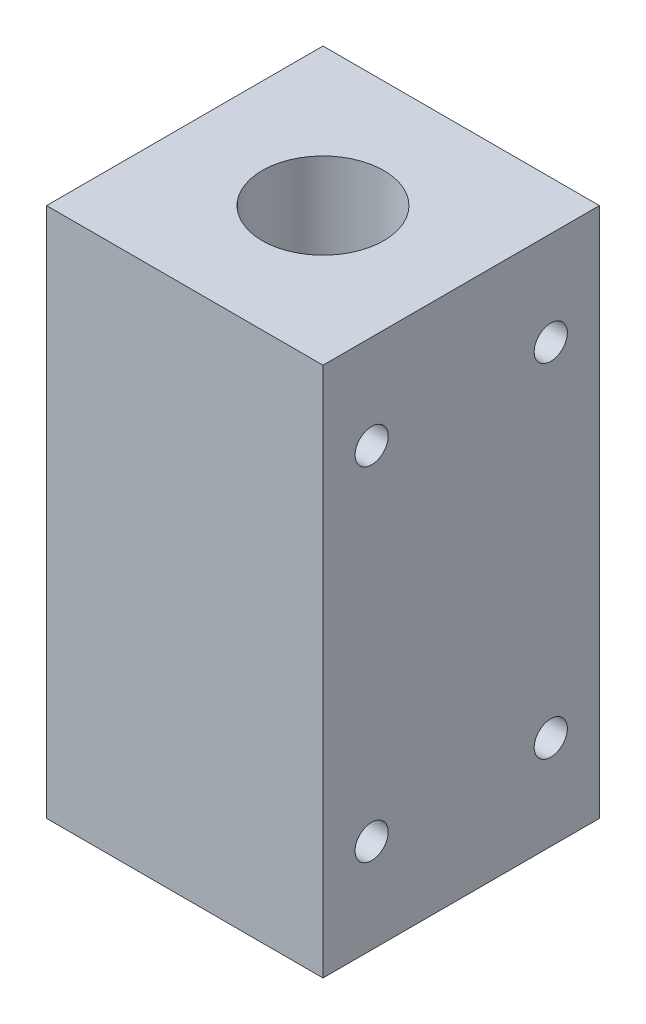
ISO-10303-21;
HEADER;
FILE_DESCRIPTION(('STEP AP214'),'2;1');
FILE_NAME('part.step','',(''),(''),'','','');
FILE_SCHEMA(('AUTOMOTIVE_DESIGN { 1 0 10303 214 1 1 1 1 }'));
ENDSEC;
DATA;
#1=APPLICATION_CONTEXT('core data for automotive mechanical design processes');
#2=APPLICATION_PROTOCOL_DEFINITION('international standard','automotive_design',2000,#1);
#3=PRODUCT_CONTEXT('',#1,'mechanical');
#4=PRODUCT('Part','Part','',(#3));
#5=PRODUCT_RELATED_PRODUCT_CATEGORY('part','',(#4));
#6=PRODUCT_DEFINITION_FORMATION('','',#4);
#7=PRODUCT_DEFINITION_CONTEXT('part definition',#1,'design');
#8=PRODUCT_DEFINITION('design','',#6,#7);
#9=PRODUCT_DEFINITION_SHAPE('','',#8);
#10=(LENGTH_UNIT() NAMED_UNIT(*) SI_UNIT(.MILLI.,.METRE.));
#11=(NAMED_UNIT(*) PLANE_ANGLE_UNIT() SI_UNIT($,.RADIAN.));
#12=(NAMED_UNIT(*) SI_UNIT($,.STERADIAN.) SOLID_ANGLE_UNIT());
#13=UNCERTAINTY_MEASURE_WITH_UNIT(LENGTH_MEASURE(1.E-05),#10,'distance_accuracy_value','');
#14=(GEOMETRIC_REPRESENTATION_CONTEXT(3) GLOBAL_UNCERTAINTY_ASSIGNED_CONTEXT((#13)) GLOBAL_UNIT_ASSIGNED_CONTEXT((#10,
#11,#12)) REPRESENTATION_CONTEXT('',''));
#15=CARTESIAN_POINT('',(0.,0.,0.));
#16=DIRECTION('',(0.,0.,1.));
#17=DIRECTION('',(1.,0.,0.));
#18=AXIS2_PLACEMENT_3D('',#15,#16,#17);
#19=CARTESIAN_POINT('',(0.,48.,0.));
#20=DIRECTION('',(0.,-1.,0.));
#21=DIRECTION('',(0.,0.,-1.));
#22=AXIS2_PLACEMENT_3D('',#19,#20,#21);
#23=PLANE('',#22);
#24=DIRECTION('',(0.,0.,1.));
#25=VECTOR('',#24,1.);
#26=CARTESIAN_POINT('',(-12.5,48.,-12.5));
#27=LINE('',#26,#25);
#28=CARTESIAN_POINT('',(-12.5,48.,-12.5));
#29=VERTEX_POINT('',#28);
#30=CARTESIAN_POINT('',(-12.5,48.,12.5));
#31=VERTEX_POINT('',#30);
#32=EDGE_CURVE('E92',#29,#31,#27,.T.);
#33=ORIENTED_EDGE('',*,*,#32,.T.);
#34=DIRECTION('',(1.,0.,0.));
#35=VECTOR('',#34,1.);
#36=CARTESIAN_POINT('',(12.5,48.,12.5));
#37=LINE('',#36,#35);
#38=CARTESIAN_POINT('',(12.5,48.,12.5));
#39=VERTEX_POINT('',#38);
#40=EDGE_CURVE('E87',#31,#39,#37,.T.);
#41=ORIENTED_EDGE('',*,*,#40,.T.);
#42=DIRECTION('',(0.,0.,-1.));
#43=VECTOR('',#42,1.);
#44=CARTESIAN_POINT('',(12.5,48.,-12.5));
#45=LINE('',#44,#43);
#46=CARTESIAN_POINT('',(12.5,48.,-12.5));
#47=VERTEX_POINT('',#46);
#48=EDGE_CURVE('E90',#39,#47,#45,.T.);
#49=ORIENTED_EDGE('',*,*,#48,.T.);
#50=DIRECTION('',(-1.,0.,0.));
#51=VECTOR('',#50,1.);
#52=CARTESIAN_POINT('',(12.5,48.,-12.5));
#53=LINE('',#52,#51);
#54=EDGE_CURVE('E57',#47,#29,#53,.T.);
#55=ORIENTED_EDGE('',*,*,#54,.T.);
#56=EDGE_LOOP('',(#33,#41,#49,#55));
#57=FACE_BOUND('',#56,.T.);
#58=CARTESIAN_POINT('',(0.,48.,0.));
#59=DIRECTION('',(0.,1.,0.));
#60=DIRECTION('',(0.,0.,1.));
#61=AXIS2_PLACEMENT_3D('',#58,#59,#60);
#62=CIRCLE('',#61,5.5);
#63=CARTESIAN_POINT('',(0.,48.,5.5));
#64=VERTEX_POINT('',#63);
#65=EDGE_CURVE('E112',#64,#64,#62,.T.);
#66=ORIENTED_EDGE('',*,*,#65,.F.);
#67=EDGE_LOOP('',(#66));
#68=FACE_BOUND('',#67,.T.);
#69=ADVANCED_FACE('F39',(#57,#68),#23,.F.);
#70=CARTESIAN_POINT('',(0.,0.,0.));
#71=DIRECTION('',(0.,-1.,0.));
#72=DIRECTION('',(0.,0.,-1.));
#73=AXIS2_PLACEMENT_3D('',#70,#71,#72);
#74=PLANE('',#73);
#75=DIRECTION('',(0.,0.,1.));
#76=VECTOR('',#75,1.);
#77=CARTESIAN_POINT('',(-12.5,0.,-12.5));
#78=LINE('',#77,#76);
#79=CARTESIAN_POINT('',(-12.5,0.,-12.5));
#80=VERTEX_POINT('',#79);
#81=CARTESIAN_POINT('',(-12.5,0.,12.5));
#82=VERTEX_POINT('',#81);
#83=EDGE_CURVE('E108',#80,#82,#78,.T.);
#84=ORIENTED_EDGE('',*,*,#83,.F.);
#85=DIRECTION('',(-1.,0.,0.));
#86=VECTOR('',#85,1.);
#87=CARTESIAN_POINT('',(12.5,0.,-12.5));
#88=LINE('',#87,#86);
#89=CARTESIAN_POINT('',(12.5,0.,-12.5));
#90=VERTEX_POINT('',#89);
#91=EDGE_CURVE('E80',#90,#80,#88,.T.);
#92=ORIENTED_EDGE('',*,*,#91,.F.);
#93=DIRECTION('',(0.,0.,-1.));
#94=VECTOR('',#93,1.);
#95=CARTESIAN_POINT('',(12.5,0.,-12.5));
#96=LINE('',#95,#94);
#97=CARTESIAN_POINT('',(12.5,0.,12.5));
#98=VERTEX_POINT('',#97);
#99=EDGE_CURVE('E74',#98,#90,#96,.T.);
#100=ORIENTED_EDGE('',*,*,#99,.F.);
#101=DIRECTION('',(1.,0.,0.));
#102=VECTOR('',#101,1.);
#103=CARTESIAN_POINT('',(12.5,0.,12.5));
#104=LINE('',#103,#102);
#105=EDGE_CURVE('E97',#82,#98,#104,.T.);
#106=ORIENTED_EDGE('',*,*,#105,.F.);
#107=EDGE_LOOP('',(#84,#92,#100,#106));
#108=FACE_BOUND('',#107,.T.);
#109=CARTESIAN_POINT('',(0.,0.,0.));
#110=DIRECTION('',(0.,1.,0.));
#111=DIRECTION('',(0.,0.,1.));
#112=AXIS2_PLACEMENT_3D('',#109,#110,#111);
#113=CIRCLE('',#112,5.5);
#114=CARTESIAN_POINT('',(0.,0.,5.5));
#115=VERTEX_POINT('',#114);
#116=EDGE_CURVE('E130',#115,#115,#113,.T.);
#117=ORIENTED_EDGE('',*,*,#116,.T.);
#118=EDGE_LOOP('',(#117));
#119=FACE_BOUND('',#118,.T.);
#120=ADVANCED_FACE('F125',(#108,#119),#74,.T.);
#121=CARTESIAN_POINT('',(-12.5,48.,-12.5));
#122=DIRECTION('',(1.,0.,0.));
#123=DIRECTION('',(0.,0.,-1.));
#124=AXIS2_PLACEMENT_3D('',#121,#122,#123);
#125=PLANE('',#124);
#126=ORIENTED_EDGE('',*,*,#83,.T.);
#127=DIRECTION('',(0.,-1.,0.));
#128=VECTOR('',#127,1.);
#129=CARTESIAN_POINT('',(-12.5,48.,12.5));
#130=LINE('',#129,#128);
#131=EDGE_CURVE('E11',#31,#82,#130,.T.);
#132=ORIENTED_EDGE('',*,*,#131,.F.);
#133=ORIENTED_EDGE('',*,*,#32,.F.);
#134=DIRECTION('',(0.,-1.,0.));
#135=VECTOR('',#134,1.);
#136=CARTESIAN_POINT('',(-12.5,48.,-12.5));
#137=LINE('',#136,#135);
#138=EDGE_CURVE('E104',#29,#80,#137,.T.);
#139=ORIENTED_EDGE('',*,*,#138,.T.);
#140=EDGE_LOOP('',(#126,#132,#133,#139));
#141=FACE_BOUND('',#140,.T.);
#142=ADVANCED_FACE('F41',(#141),#125,.F.);
#143=CARTESIAN_POINT('',(12.5,48.,12.5));
#144=DIRECTION('',(0.,0.,-1.));
#145=DIRECTION('',(-1.,0.,0.));
#146=AXIS2_PLACEMENT_3D('',#143,#144,#145);
#147=PLANE('',#146);
#148=ORIENTED_EDGE('',*,*,#105,.T.);
#149=DIRECTION('',(0.,-1.,0.));
#150=VECTOR('',#149,1.);
#151=CARTESIAN_POINT('',(12.5,48.,12.5));
#152=LINE('',#151,#150);
#153=EDGE_CURVE('E49',#39,#98,#152,.T.);
#154=ORIENTED_EDGE('',*,*,#153,.F.);
#155=ORIENTED_EDGE('',*,*,#40,.F.);
#156=ORIENTED_EDGE('',*,*,#131,.T.);
#157=EDGE_LOOP('',(#148,#154,#155,#156));
#158=FACE_BOUND('',#157,.T.);
#159=ADVANCED_FACE('F96',(#158),#147,.F.);
#160=CARTESIAN_POINT('',(12.5,48.,-12.5));
#161=DIRECTION('',(-1.,0.,0.));
#162=DIRECTION('',(0.,0.,1.));
#163=AXIS2_PLACEMENT_3D('',#160,#161,#162);
#164=PLANE('',#163);
#165=CARTESIAN_POINT('',(12.5,39.5,-8.1));
#166=DIRECTION('',(1.,0.,0.));
#167=DIRECTION('',(0.,0.,1.));
#168=AXIS2_PLACEMENT_3D('',#165,#166,#167);
#169=CIRCLE('',#168,1.5);
#170=CARTESIAN_POINT('',(12.5,39.5,-6.6));
#171=VERTEX_POINT('',#170);
#172=EDGE_CURVE('E146',#171,#171,#169,.T.);
#173=ORIENTED_EDGE('',*,*,#172,.F.);
#174=EDGE_LOOP('',(#173));
#175=FACE_BOUND('',#174,.T.);
#176=CARTESIAN_POINT('',(12.5,39.5,8.1));
#177=DIRECTION('',(1.,0.,0.));
#178=DIRECTION('',(0.,0.,-1.));
#179=AXIS2_PLACEMENT_3D('',#176,#177,#178);
#180=CIRCLE('',#179,1.5);
#181=CARTESIAN_POINT('',(12.5,39.5,6.6));
#182=VERTEX_POINT('',#181);
#183=EDGE_CURVE('E154',#182,#182,#180,.T.);
#184=ORIENTED_EDGE('',*,*,#183,.F.);
#185=EDGE_LOOP('',(#184));
#186=FACE_BOUND('',#185,.T.);
#187=CARTESIAN_POINT('',(12.5,8.5,8.1));
#188=DIRECTION('',(1.,0.,0.));
#189=DIRECTION('',(0.,0.,1.));
#190=AXIS2_PLACEMENT_3D('',#187,#188,#189);
#191=CIRCLE('',#190,1.5);
#192=CARTESIAN_POINT('',(12.5,8.5,9.6));
#193=VERTEX_POINT('',#192);
#194=EDGE_CURVE('E162',#193,#193,#191,.T.);
#195=ORIENTED_EDGE('',*,*,#194,.F.);
#196=EDGE_LOOP('',(#195));
#197=FACE_BOUND('',#196,.T.);
#198=CARTESIAN_POINT('',(12.5,8.5,-8.1));
#199=DIRECTION('',(1.,0.,0.));
#200=DIRECTION('',(0.,0.,-1.));
#201=AXIS2_PLACEMENT_3D('',#198,#199,#200);
#202=CIRCLE('',#201,1.5);
#203=CARTESIAN_POINT('',(12.5,8.5,-9.6));
#204=VERTEX_POINT('',#203);
#205=EDGE_CURVE('E138',#204,#204,#202,.T.);
#206=ORIENTED_EDGE('',*,*,#205,.F.);
#207=EDGE_LOOP('',(#206));
#208=FACE_BOUND('',#207,.T.);
#209=ORIENTED_EDGE('',*,*,#99,.T.);
#210=DIRECTION('',(0.,-1.,0.));
#211=VECTOR('',#210,1.);
#212=CARTESIAN_POINT('',(12.5,48.,-12.5));
#213=LINE('',#212,#211);
#214=EDGE_CURVE('E99',#47,#90,#213,.T.);
#215=ORIENTED_EDGE('',*,*,#214,.F.);
#216=ORIENTED_EDGE('',*,*,#48,.F.);
#217=ORIENTED_EDGE('',*,*,#153,.T.);
#218=EDGE_LOOP('',(#209,#215,#216,#217));
#219=FACE_BOUND('',#218,.T.);
#220=ADVANCED_FACE('F100',(#175,#186,#197,#208,#219),#164,.F.);
#221=CARTESIAN_POINT('',(12.5,48.,-12.5));
#222=DIRECTION('',(0.,0.,1.));
#223=DIRECTION('',(1.,0.,0.));
#224=AXIS2_PLACEMENT_3D('',#221,#222,#223);
#225=PLANE('',#224);
#226=ORIENTED_EDGE('',*,*,#91,.T.);
#227=ORIENTED_EDGE('',*,*,#138,.F.);
#228=ORIENTED_EDGE('',*,*,#54,.F.);
#229=ORIENTED_EDGE('',*,*,#214,.T.);
#230=EDGE_LOOP('',(#226,#227,#228,#229));
#231=FACE_BOUND('',#230,.T.);
#232=ADVANCED_FACE('F122',(#231),#225,.F.);
#233=CARTESIAN_POINT('',(0.,48.,0.));
#234=DIRECTION('',(0.,-1.,0.));
#235=DIRECTION('',(0.,0.,-1.));
#236=AXIS2_PLACEMENT_3D('',#233,#234,#235);
#237=CYLINDRICAL_SURFACE('',#236,5.5);
#238=ORIENTED_EDGE('',*,*,#65,.T.);
#239=EDGE_LOOP('',(#238));
#240=FACE_BOUND('',#239,.T.);
#241=ORIENTED_EDGE('',*,*,#116,.F.);
#242=EDGE_LOOP('',(#241));
#243=FACE_BOUND('',#242,.T.);
#244=ADVANCED_FACE('F187',(#240,#243),#237,.F.);
#245=CARTESIAN_POINT('',(7.5,8.5,-8.1));
#246=DIRECTION('',(1.,0.,0.));
#247=DIRECTION('',(0.,0.,-1.));
#248=AXIS2_PLACEMENT_3D('',#245,#246,#247);
#249=CYLINDRICAL_SURFACE('',#248,1.5);
#250=CARTESIAN_POINT('',(7.5,8.5,-8.1));
#251=DIRECTION('',(1.,0.,0.));
#252=DIRECTION('',(0.,0.,-1.));
#253=AXIS2_PLACEMENT_3D('',#250,#251,#252);
#254=CIRCLE('',#253,1.5);
#255=CARTESIAN_POINT('',(7.5,8.5,-9.6));
#256=VERTEX_POINT('',#255);
#257=EDGE_CURVE('E134',#256,#256,#254,.T.);
#258=ORIENTED_EDGE('',*,*,#257,.F.);
#259=EDGE_LOOP('',(#258));
#260=FACE_BOUND('',#259,.T.);
#261=ORIENTED_EDGE('',*,*,#205,.T.);
#262=EDGE_LOOP('',(#261));
#263=FACE_BOUND('',#262,.T.);
#264=ADVANCED_FACE('F185',(#260,#263),#249,.F.);
#265=CARTESIAN_POINT('',(7.5,8.5,-8.1));
#266=DIRECTION('',(1.,0.,0.));
#267=DIRECTION('',(0.,0.,-1.));
#268=AXIS2_PLACEMENT_3D('',#265,#266,#267);
#269=PLANE('',#268);
#270=ORIENTED_EDGE('',*,*,#257,.T.);
#271=EDGE_LOOP('',(#270));
#272=FACE_BOUND('',#271,.T.);
#273=ADVANCED_FACE('F175',(#272),#269,.T.);
#274=CARTESIAN_POINT('',(7.5,8.5,8.1));
#275=DIRECTION('',(1.,0.,0.));
#276=DIRECTION('',(0.,0.,-1.));
#277=AXIS2_PLACEMENT_3D('',#274,#275,#276);
#278=CYLINDRICAL_SURFACE('',#277,1.5);
#279=CARTESIAN_POINT('',(7.5,8.5,8.1));
#280=DIRECTION('',(1.,0.,0.));
#281=DIRECTION('',(0.,0.,1.));
#282=AXIS2_PLACEMENT_3D('',#279,#280,#281);
#283=CIRCLE('',#282,1.5);
#284=CARTESIAN_POINT('',(7.5,8.5,9.6));
#285=VERTEX_POINT('',#284);
#286=EDGE_CURVE('E142',#285,#285,#283,.T.);
#287=ORIENTED_EDGE('',*,*,#286,.F.);
#288=EDGE_LOOP('',(#287));
#289=FACE_BOUND('',#288,.T.);
#290=ORIENTED_EDGE('',*,*,#194,.T.);
#291=EDGE_LOOP('',(#290));
#292=FACE_BOUND('',#291,.T.);
#293=ADVANCED_FACE('F172',(#289,#292),#278,.F.);
#294=CARTESIAN_POINT('',(7.5,8.5,8.1));
#295=DIRECTION('',(-1.,0.,0.));
#296=DIRECTION('',(0.,0.,1.));
#297=AXIS2_PLACEMENT_3D('',#294,#295,#296);
#298=PLANE('',#297);
#299=ORIENTED_EDGE('',*,*,#286,.T.);
#300=EDGE_LOOP('',(#299));
#301=FACE_BOUND('',#300,.T.);
#302=ADVANCED_FACE('F170',(#301),#298,.F.);
#303=CARTESIAN_POINT('',(7.5,39.5,8.1));
#304=DIRECTION('',(1.,0.,0.));
#305=DIRECTION('',(0.,0.,-1.));
#306=AXIS2_PLACEMENT_3D('',#303,#304,#305);
#307=CYLINDRICAL_SURFACE('',#306,1.5);
#308=CARTESIAN_POINT('',(7.5,39.5,8.1));
#309=DIRECTION('',(1.,0.,0.));
#310=DIRECTION('',(0.,0.,-1.));
#311=AXIS2_PLACEMENT_3D('',#308,#309,#310);
#312=CIRCLE('',#311,1.5);
#313=CARTESIAN_POINT('',(7.5,39.5,6.6));
#314=VERTEX_POINT('',#313);
#315=EDGE_CURVE('E158',#314,#314,#312,.T.);
#316=ORIENTED_EDGE('',*,*,#315,.F.);
#317=EDGE_LOOP('',(#316));
#318=FACE_BOUND('',#317,.T.);
#319=ORIENTED_EDGE('',*,*,#183,.T.);
#320=EDGE_LOOP('',(#319));
#321=FACE_BOUND('',#320,.T.);
#322=ADVANCED_FACE('F266',(#318,#321),#307,.F.);
#323=CARTESIAN_POINT('',(7.5,39.5,8.1));
#324=DIRECTION('',(1.,0.,0.));
#325=DIRECTION('',(0.,0.,-1.));
#326=AXIS2_PLACEMENT_3D('',#323,#324,#325);
#327=PLANE('',#326);
#328=ORIENTED_EDGE('',*,*,#315,.T.);
#329=EDGE_LOOP('',(#328));
#330=FACE_BOUND('',#329,.T.);
#331=ADVANCED_FACE('F274',(#330),#327,.T.);
#332=CARTESIAN_POINT('',(7.5,39.5,-8.1));
#333=DIRECTION('',(1.,0.,0.));
#334=DIRECTION('',(0.,0.,-1.));
#335=AXIS2_PLACEMENT_3D('',#332,#333,#334);
#336=CYLINDRICAL_SURFACE('',#335,1.5);
#337=CARTESIAN_POINT('',(7.5,39.5,-8.1));
#338=DIRECTION('',(1.,0.,0.));
#339=DIRECTION('',(0.,0.,1.));
#340=AXIS2_PLACEMENT_3D('',#337,#338,#339);
#341=CIRCLE('',#340,1.5);
#342=CARTESIAN_POINT('',(7.5,39.5,-6.6));
#343=VERTEX_POINT('',#342);
#344=EDGE_CURVE('E150',#343,#343,#341,.T.);
#345=ORIENTED_EDGE('',*,*,#344,.F.);
#346=EDGE_LOOP('',(#345));
#347=FACE_BOUND('',#346,.T.);
#348=ORIENTED_EDGE('',*,*,#172,.T.);
#349=EDGE_LOOP('',(#348));
#350=FACE_BOUND('',#349,.T.);
#351=ADVANCED_FACE('F283',(#347,#350),#336,.F.);
#352=CARTESIAN_POINT('',(7.5,39.5,-8.1));
#353=DIRECTION('',(-1.,0.,0.));
#354=DIRECTION('',(0.,0.,1.));
#355=AXIS2_PLACEMENT_3D('',#352,#353,#354);
#356=PLANE('',#355);
#357=ORIENTED_EDGE('',*,*,#344,.T.);
#358=EDGE_LOOP('',(#357));
#359=FACE_BOUND('',#358,.T.);
#360=ADVANCED_FACE('F292',(#359),#356,.F.);
#361=CLOSED_SHELL('',(#69,#120,#142,#159,#220,#232,#244,#264,#273,#293,#302,#322,#331,#351,#360));
#362=MANIFOLD_SOLID_BREP('B2',#361);
#363=ADVANCED_BREP_SHAPE_REPRESENTATION('',(#18,#362),#14);
#364=SHAPE_DEFINITION_REPRESENTATION(#9,#363);
ENDSEC;
END-ISO-10303-21;
